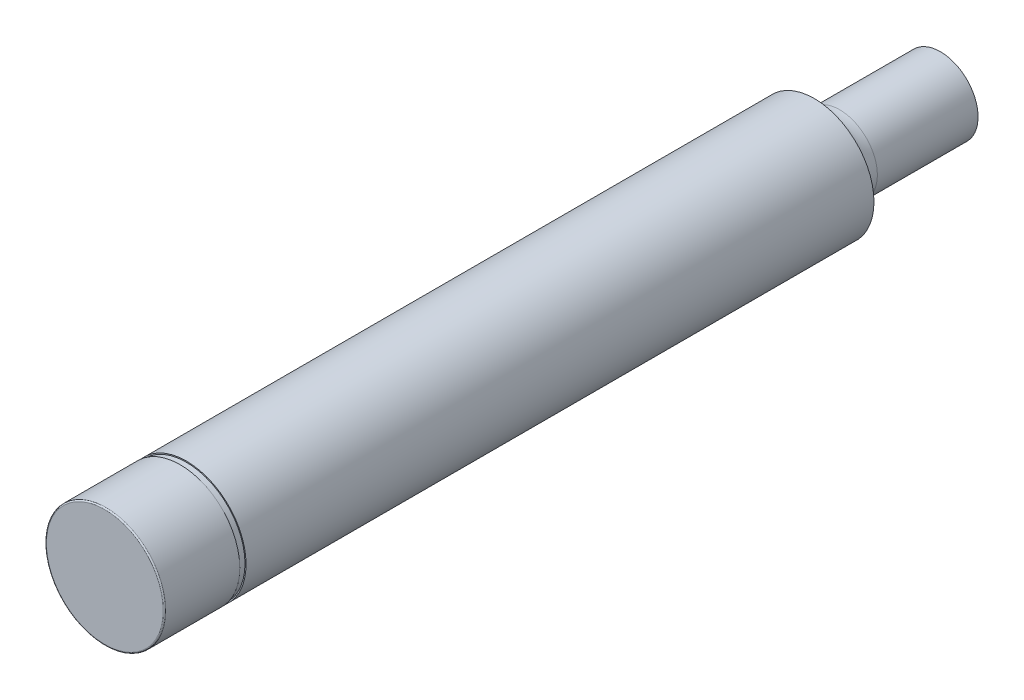
ISO-10303-21;
HEADER;
FILE_DESCRIPTION(('STEP AP214'),'2;1');
FILE_NAME('part.step','',(''),(''),'','','');
FILE_SCHEMA(('AUTOMOTIVE_DESIGN { 1 0 10303 214 1 1 1 1 }'));
ENDSEC;
DATA;
#1=APPLICATION_CONTEXT('core data for automotive mechanical design processes');
#2=APPLICATION_PROTOCOL_DEFINITION('international standard','automotive_design',2000,#1);
#3=PRODUCT_CONTEXT('',#1,'mechanical');
#4=PRODUCT('Part','Part','',(#3));
#5=PRODUCT_RELATED_PRODUCT_CATEGORY('part','',(#4));
#6=PRODUCT_DEFINITION_FORMATION('','',#4);
#7=PRODUCT_DEFINITION_CONTEXT('part definition',#1,'design');
#8=PRODUCT_DEFINITION('design','',#6,#7);
#9=PRODUCT_DEFINITION_SHAPE('','',#8);
#10=(LENGTH_UNIT() NAMED_UNIT(*) SI_UNIT(.MILLI.,.METRE.));
#11=(NAMED_UNIT(*) PLANE_ANGLE_UNIT() SI_UNIT($,.RADIAN.));
#12=(NAMED_UNIT(*) SI_UNIT($,.STERADIAN.) SOLID_ANGLE_UNIT());
#13=UNCERTAINTY_MEASURE_WITH_UNIT(LENGTH_MEASURE(1.E-05),#10,'distance_accuracy_value','');
#14=(GEOMETRIC_REPRESENTATION_CONTEXT(3) GLOBAL_UNCERTAINTY_ASSIGNED_CONTEXT((#13)) GLOBAL_UNIT_ASSIGNED_CONTEXT((#10,
#11,#12)) REPRESENTATION_CONTEXT('',''));
#15=CARTESIAN_POINT('',(0.,0.,0.));
#16=DIRECTION('',(0.,0.,1.));
#17=DIRECTION('',(1.,0.,0.));
#18=AXIS2_PLACEMENT_3D('',#15,#16,#17);
#19=CARTESIAN_POINT('',(0.,0.,0.));
#20=DIRECTION('',(0.,0.,1.));
#21=DIRECTION('',(1.,0.,0.));
#22=AXIS2_PLACEMENT_3D('',#19,#20,#21);
#23=PLANE('',#22);
#24=CARTESIAN_POINT('',(0.,0.,0.));
#25=DIRECTION('',(0.,0.,1.));
#26=DIRECTION('',(1.,0.,0.));
#27=AXIS2_PLACEMENT_3D('',#24,#25,#26);
#28=CIRCLE('',#27,2.);
#29=CARTESIAN_POINT('',(2.,0.,0.));
#30=VERTEX_POINT('',#29);
#31=EDGE_CURVE('E114',#30,#30,#28,.T.);
#32=ORIENTED_EDGE('',*,*,#31,.T.);
#33=EDGE_LOOP('',(#32));
#34=FACE_BOUND('',#33,.T.);
#35=CARTESIAN_POINT('',(0.038873115756179,0.,0.));
#36=DIRECTION('',(0.,0.,-1.));
#37=DIRECTION('',(-1.,0.,0.));
#38=AXIS2_PLACEMENT_3D('',#35,#36,#37);
#39=CIRCLE('',#38,3.);
#40=CARTESIAN_POINT('',(-2.96112688424382,0.,0.));
#41=VERTEX_POINT('',#40);
#42=EDGE_CURVE('E115',#41,#41,#39,.T.);
#43=ORIENTED_EDGE('',*,*,#42,.T.);
#44=EDGE_LOOP('',(#43));
#45=FACE_BOUND('',#44,.T.);
#46=ADVANCED_FACE('F40',(#34,#45),#23,.F.);
#47=CARTESIAN_POINT('',(0.,0.,60.));
#48=DIRECTION('',(0.,0.,-1.));
#49=DIRECTION('',(-1.,0.,0.));
#50=AXIS2_PLACEMENT_3D('',#47,#48,#49);
#51=CYLINDRICAL_SURFACE('',#50,4.75);
#52=CARTESIAN_POINT('',(0.,0.,60.));
#53=DIRECTION('',(0.,0.,1.));
#54=DIRECTION('',(1.,0.,0.));
#55=AXIS2_PLACEMENT_3D('',#52,#53,#54);
#56=CIRCLE('',#55,4.75);
#57=CARTESIAN_POINT('',(4.75,0.,60.));
#58=VERTEX_POINT('',#57);
#59=EDGE_CURVE('E117',#58,#58,#56,.T.);
#60=ORIENTED_EDGE('',*,*,#59,.F.);
#61=EDGE_LOOP('',(#60));
#62=FACE_BOUND('',#61,.T.);
#63=CARTESIAN_POINT('',(-4.75,0.,10.));
#64=CARTESIAN_POINT('',(-4.75001626152837,0.626174740003221,10.));
#65=CARTESIAN_POINT('',(-4.49907437973222,1.87880300784494,10.));
#66=CARTESIAN_POINT('',(-3.42711531146558,3.46754349275447,10.));
#67=CARTESIAN_POINT('',(-1.83012336098341,4.51779933947683,10.));
#68=CARTESIAN_POINT('',(0.0399095150425289,4.8732862767297,10.));
#69=CARTESIAN_POINT('',(1.89712141983918,4.48815441777118,10.));
#70=CARTESIAN_POINT('',(3.46278915198452,3.4273935554428,10.));
#71=CARTESIAN_POINT('',(4.50530923879185,1.85326143166033,10.));
#72=CARTESIAN_POINT('',(4.872463337825,0.00324386234706493,10.));
#73=CARTESIAN_POINT('',(4.50483561329711,-1.85611725521611,10.));
#74=CARTESIAN_POINT('',(3.46302080284727,-3.4264988058695,10.));
#75=CARTESIAN_POINT('',(1.89662552694967,-4.48892094096583,10.));
#76=CARTESIAN_POINT('',(0.0354728978590639,-4.87372853472948,9.99999999999997));
#77=CARTESIAN_POINT('',(-1.83585952835088,-4.51544438295885,10.));
#78=CARTESIAN_POINT('',(-3.42964271691283,-3.46437605227857,10.));
#79=CARTESIAN_POINT('',(-4.49897681056203,-1.87824543217439,10.));
#80=CARTESIAN_POINT('',(-4.74998373847164,-0.626174740003219,10.));
#81=CARTESIAN_POINT('',(-4.75,0.,10.));
#82=B_SPLINE_CURVE_WITH_KNOTS('',3,(#63,#64,#65,#66,#67,#68,#69,#70,#71,#72,#73,#74,#75,#76,#77,
#78,#79,#80,#81),.UNSPECIFIED.,.T.,.F.,(4,1,1,1,1,1,1,1,1,1,1,1,1,1,1,1,4),(-0.0307384777592751,
-0.028784661948106,-0.0268308461369369,-0.0248770303257678,-0.0229232145145987,
-0.0209693987034295,-0.0190155828922604,-0.0170617670810913,-0.0151079512699222,
-0.0131541354587531,-0.0112003196475839,-0.00924650383641482,-0.0072926880252457,
-0.00533887221407657,-0.00338505640290745,-0.00143124059173833,0.00052257521943079),.UNSPECIFIED.);
#83=CARTESIAN_POINT('',(-4.75,0.,10.));
#84=VERTEX_POINT('',#83);
#85=EDGE_CURVE('E111',#84,#84,#82,.T.);
#86=ORIENTED_EDGE('',*,*,#85,.F.);
#87=EDGE_LOOP('',(#86));
#88=FACE_BOUND('',#87,.T.);
#89=ADVANCED_FACE('F64',(#62,#88),#51,.T.);
#90=CARTESIAN_POINT('',(0.,0.,60.));
#91=DIRECTION('',(0.,0.,1.));
#92=DIRECTION('',(1.,0.,0.));
#93=AXIS2_PLACEMENT_3D('',#90,#91,#92);
#94=PLANE('',#93);
#95=CARTESIAN_POINT('',(0.,0.,60.));
#96=DIRECTION('',(0.,0.,1.));
#97=DIRECTION('',(1.,0.,0.));
#98=AXIS2_PLACEMENT_3D('',#95,#96,#97);
#99=CIRCLE('',#98,4.66340729655614);
#100=CARTESIAN_POINT('',(4.66340729655614,0.,60.));
#101=VERTEX_POINT('',#100);
#102=EDGE_CURVE('E51',#101,#101,#99,.T.);
#103=ORIENTED_EDGE('',*,*,#102,.F.);
#104=EDGE_LOOP('',(#103));
#105=FACE_BOUND('',#104,.T.);
#106=ORIENTED_EDGE('',*,*,#59,.T.);
#107=EDGE_LOOP('',(#106));
#108=FACE_BOUND('',#107,.T.);
#109=ADVANCED_FACE('F74',(#105,#108),#94,.T.);
#110=CARTESIAN_POINT('',(0.,0.,60.));
#111=DIRECTION('',(0.,0.,-1.));
#112=DIRECTION('',(-1.,0.,0.));
#113=AXIS2_PLACEMENT_3D('',#110,#111,#112);
#114=CYLINDRICAL_SURFACE('',#113,2.);
#115=CARTESIAN_POINT('',(0.,0.,56.5358983848623));
#116=DIRECTION('',(0.,0.,1.));
#117=DIRECTION('',(1.,0.,0.));
#118=AXIS2_PLACEMENT_3D('',#115,#116,#117);
#119=CIRCLE('',#118,2.);
#120=CARTESIAN_POINT('',(2.,0.,56.5358983848623));
#121=VERTEX_POINT('',#120);
#122=EDGE_CURVE('E130',#121,#121,#119,.T.);
#123=ORIENTED_EDGE('',*,*,#122,.T.);
#124=EDGE_LOOP('',(#123));
#125=FACE_BOUND('',#124,.T.);
#126=ORIENTED_EDGE('',*,*,#31,.F.);
#127=EDGE_LOOP('',(#126));
#128=FACE_BOUND('',#127,.T.);
#129=ADVANCED_FACE('F80',(#125,#128),#114,.F.);
#130=CARTESIAN_POINT('',(0.,0.,56.5358983848623));
#131=DIRECTION('',(0.,0.,1.));
#132=DIRECTION('',(1.,0.,0.));
#133=AXIS2_PLACEMENT_3D('',#130,#131,#132);
#134=CONICAL_SURFACE('',#133,2.,0.5235987755983);
#135=CARTESIAN_POINT('',(0.,0.,60.));
#136=DIRECTION('',(0.,0.,1.));
#137=DIRECTION('',(1.,0.,0.));
#138=AXIS2_PLACEMENT_3D('',#135,#136,#137);
#139=CIRCLE('',#138,3.99999999999999);
#140=CARTESIAN_POINT('',(3.99999999999999,0.,60.));
#141=VERTEX_POINT('',#140);
#142=EDGE_CURVE('E133',#141,#141,#139,.F.);
#143=ORIENTED_EDGE('',*,*,#142,.F.);
#144=EDGE_LOOP('',(#143));
#145=FACE_BOUND('',#144,.T.);
#146=ORIENTED_EDGE('',*,*,#122,.F.);
#147=EDGE_LOOP('',(#146));
#148=FACE_BOUND('',#147,.T.);
#149=ADVANCED_FACE('F77',(#145,#148),#134,.F.);
#150=CARTESIAN_POINT('',(0.038873115756179,0.,10.));
#151=DIRECTION('',(0.,0.,-1.));
#152=DIRECTION('',(-1.,0.,0.));
#153=AXIS2_PLACEMENT_3D('',#150,#151,#152);
#154=CYLINDRICAL_SURFACE('',#153,3.);
#155=CARTESIAN_POINT('',(-2.96112688424382,0.,8.01117485968487));
#156=CARTESIAN_POINT('',(-2.9611167007564,-0.39241073710059,8.01117487493159));
#157=CARTESIAN_POINT('',(-2.80513779411453,-1.1770582123849,8.0113895985819));
#158=CARTESIAN_POINT('',(-2.13897284038856,-2.17506144525743,8.01233287503525));
#159=CARTESIAN_POINT('',(-1.14150703205925,-2.84276039904291,8.01381749470189));
#160=CARTESIAN_POINT('',(0.0366896787045898,-3.07823477431649,8.01568206089719));
#161=CARTESIAN_POINT('',(1.21604127029261,-2.84429653978128,8.01766811308753));
#162=CARTESIAN_POINT('',(2.21448172219551,-2.17697907506071,8.01944247489447));
#163=CARTESIAN_POINT('',(2.88152292111241,-1.18137637259871,8.02067509204745));
#164=CARTESIAN_POINT('',(3.11747204943919,0.00206427816775088,8.02112012341305));
#165=CARTESIAN_POINT('',(2.88182642325387,1.17956029283598,8.02067565690416));
#166=CARTESIAN_POINT('',(2.21433308655281,2.17754753299249,8.01944219530179));
#167=CARTESIAN_POINT('',(1.21635971481586,2.84381140806213,8.01766871608865));
#168=CARTESIAN_POINT('',(0.0394966668773256,3.07797927521568,8.01568671911628));
#169=CARTESIAN_POINT('',(-1.1379077792681,2.84427120664698,8.0138229978946));
#170=CARTESIAN_POINT('',(-2.13739797543183,2.17705728145469,8.01233511060332));
#171=CARTESIAN_POINT('',(-2.80519889503904,1.17740621021864,8.01138950710157));
#172=CARTESIAN_POINT('',(-2.96113706773124,0.392410737100591,8.01117484443815));
#173=CARTESIAN_POINT('',(-2.96112688424382,0.,8.01117485968487));
#174=B_SPLINE_CURVE_WITH_KNOTS('',3,(#155,#156,#157,#158,#159,#160,#161,#162,#163,#164,#165,
#166,#167,#168,#169,#170,#171,#172,#173),.UNSPECIFIED.,.T.,.F.,(4,1,1,1,1,1,1,1,1,1,1,1,1,1,1,1,
4),(-0.0307384777592751,-0.028784661948106,-0.0268308461369369,-0.0248770303257678,
-0.0229232145145987,-0.0209693987034295,-0.0190155828922604,-0.0170617670810913,
-0.0151079512699222,-0.0131541354587531,-0.0112003196475839,-0.00924650383641481,
-0.00729268802524569,-0.00533887221407657,-0.00338505640290745,-0.00143124059173833,
0.00052257521943079),.UNSPECIFIED.);
#175=CARTESIAN_POINT('',(-2.96112688424382,0.,8.01117485968487));
#176=VERTEX_POINT('',#175);
#177=EDGE_CURVE('E55',#176,#176,#174,.F.);
#178=ORIENTED_EDGE('',*,*,#177,.T.);
#179=EDGE_LOOP('',(#178));
#180=FACE_BOUND('',#179,.T.);
#181=ORIENTED_EDGE('',*,*,#42,.F.);
#182=EDGE_LOOP('',(#181));
#183=FACE_BOUND('',#182,.T.);
#184=ADVANCED_FACE('F79',(#180,#183),#154,.T.);
#185=CARTESIAN_POINT('',(-4.75,0.,10.));
#186=CARTESIAN_POINT('',(-4.74998373847164,-0.626174740003219,10.));
#187=CARTESIAN_POINT('',(-4.49897681056203,-1.87824543217439,10.));
#188=CARTESIAN_POINT('',(-3.42964271691283,-3.46437605227857,10.));
#189=CARTESIAN_POINT('',(-1.83585952835088,-4.51544438295885,10.));
#190=CARTESIAN_POINT('',(0.0354728978590639,-4.87372853472948,9.99999999999997));
#191=CARTESIAN_POINT('',(1.89662552694967,-4.48892094096583,10.));
#192=CARTESIAN_POINT('',(3.46302080284727,-3.4264988058695,10.));
#193=CARTESIAN_POINT('',(4.50483561329711,-1.85611725521611,10.));
#194=CARTESIAN_POINT('',(4.872463337825,0.00324386234706493,10.));
#195=CARTESIAN_POINT('',(4.50530923879185,1.85326143166033,10.));
#196=CARTESIAN_POINT('',(3.46278915198452,3.4273935554428,10.));
#197=CARTESIAN_POINT('',(1.89712141983918,4.48815441777118,10.));
#198=CARTESIAN_POINT('',(0.0399095150425289,4.8732862767297,10.));
#199=CARTESIAN_POINT('',(-1.83012336098341,4.51779933947683,10.));
#200=CARTESIAN_POINT('',(-3.42711531146558,3.46754349275447,10.));
#201=CARTESIAN_POINT('',(-4.49907437973222,1.87880300784494,10.));
#202=CARTESIAN_POINT('',(-4.75001626152837,0.626174740003221,10.));
#203=CARTESIAN_POINT('',(-4.75,0.,10.));
#204=CARTESIAN_POINT('',(-4.44419443789605,0.,9.96753672597823));
#205=CARTESIAN_POINT('',(-4.44417921650944,-0.586179397555377,9.96753670777059));
#206=CARTESIAN_POINT('',(-4.20939551553512,-1.75827731365213,9.96725172871922));
#207=CARTESIAN_POINT('',(-3.20894099051278,-3.24367309943672,9.96604308530858));
#208=CARTESIAN_POINT('',(-1.71716615176227,-4.22891402071835,9.96425655990618));
#209=CARTESIAN_POINT('',(0.0354141985363997,-4.56592297481237,9.96218173808099));
#210=CARTESIAN_POINT('',(1.7795837841437,-4.20678006587591,9.96014275922609));
#211=CARTESIAN_POINT('',(3.24841276997896,-3.21202257043358,9.95844575029787));
#212=CARTESIAN_POINT('',(4.22579495445339,-1.74026088104148,9.95732672763041));
#213=CARTESIAN_POINT('',(4.57077491432439,0.00304132876336575,9.95693370332844));
#214=CARTESIAN_POINT('',(4.2262393270694,1.73758355748524,9.95732621973223));
#215=CARTESIAN_POINT('',(3.24819539877803,3.21286131196486,9.95844599808774));
#216=CARTESIAN_POINT('',(1.78004914586522,4.20606181265877,9.96014222963241));
#217=CARTESIAN_POINT('',(0.0395712948335787,4.56551219826176,9.96217686343642));
#218=CARTESIAN_POINT('',(-1.71179578620148,4.2311236636193,9.96425016019448));
#219=CARTESIAN_POINT('',(-3.20657633596022,3.24663978600776,9.96604022982195));
#220=CARTESIAN_POINT('',(-4.20948684385479,1.75879907168014,9.96725183796504));
#221=CARTESIAN_POINT('',(-4.44420965928267,0.586179397555378,9.96753674418587));
#222=CARTESIAN_POINT('',(-4.44419443789605,0.,9.96753672597823));
#223=CARTESIAN_POINT('',(-4.13838887579211,0.,9.93507345195646));
#224=CARTESIAN_POINT('',(-4.13837469454725,-0.546184055107535,9.93507341554119));
#225=CARTESIAN_POINT('',(-3.91981422050821,-1.63830919512987,9.93450345743843));
#226=CARTESIAN_POINT('',(-2.98823926411274,-3.02297014659487,9.93208617061716));
#227=CARTESIAN_POINT('',(-1.59847277517367,-3.94238365847785,9.92851311981237));
#228=CARTESIAN_POINT('',(0.0353554992137356,-4.25811741489526,9.92436347616201));
#229=CARTESIAN_POINT('',(1.66254204133773,-3.924639190786,9.92028551845217));
#230=CARTESIAN_POINT('',(3.03380473711064,-2.99754633499766,9.91689150059574));
#231=CARTESIAN_POINT('',(3.94675429560969,-1.62440450686685,9.91465345526081));
#232=CARTESIAN_POINT('',(4.26908649082379,0.00283879517966656,9.91386740665688));
#233=CARTESIAN_POINT('',(3.94716941534696,1.62190568331015,9.91465243946446));
#234=CARTESIAN_POINT('',(3.03360164557154,2.99832906848692,9.91689199617547));
#235=CARTESIAN_POINT('',(1.66297687189125,3.92396920754635,9.92028445926483));
#236=CARTESIAN_POINT('',(0.039233074624629,4.25773811979383,9.92435372687284));
#237=CARTESIAN_POINT('',(-1.59346821141955,3.94444798776177,9.92850032038896));
#238=CARTESIAN_POINT('',(-2.98603736045487,3.02573607926105,9.93208045964389));
#239=CARTESIAN_POINT('',(-3.91989930797737,1.63879513551534,9.93450367593008));
#240=CARTESIAN_POINT('',(-4.13840305703697,0.546184055107536,9.93507348837174));
#241=CARTESIAN_POINT('',(-4.13838887579211,0.,9.93507345195646));
#242=CARTESIAN_POINT('',(-3.47414104562806,0.,9.74328807973543));
#243=CARTESIAN_POINT('',(-3.47412912356626,-0.459322865214973,9.74328801703306));
#244=CARTESIAN_POINT('',(-3.29089226499379,-1.37776456799209,9.74230438829811));
#245=CARTESIAN_POINT('',(-2.50917602110838,-2.5439234146079,9.73813569215621));
#246=CARTESIAN_POINT('',(-1.34103230844384,-3.32097523686039,9.7319822099384));
#247=CARTESIAN_POINT('',(0.0352620524341726,-3.59121435484807,9.72484865178556));
#248=CARTESIAN_POINT('',(1.40923649763483,-3.31392078457066,9.71785238301314));
#249=CARTESIAN_POINT('',(2.56967943545147,-2.53365802104055,9.71204052955154));
#250=CARTESIAN_POINT('',(3.34358381542262,-1.37394937898276,9.70821379240854));
#251=CARTESIAN_POINT('',(3.6170761056637,0.00240094111460118,9.70687085411932));
#252=CARTESIAN_POINT('',(3.34393582322602,1.37183652882625,9.7082120560319));
#253=CARTESIAN_POINT('',(2.56950713856198,2.53431961584283,9.71204137631365));
#254=CARTESIAN_POINT('',(1.40960550516451,3.31335531425659,9.717850573758));
#255=CARTESIAN_POINT('',(0.0385343264195018,3.59090479445951,9.72483191742958));
#256=CARTESIAN_POINT('',(-1.33682185669345,3.32272628575136,9.73196018395262));
#257=CARTESIAN_POINT('',(-2.50732818077118,2.54625409217965,9.73812584404507));
#258=CARTESIAN_POINT('',(-3.29096379736457,1.37817262329775,9.74230476451238));
#259=CARTESIAN_POINT('',(-3.47415296768986,0.459322865214974,9.74328814243781));
#260=CARTESIAN_POINT('',(-3.47414104562806,0.,9.74328807973543));
#261=CARTESIAN_POINT('',(-3.08172038177863,0.,9.30700443559727));
#262=CARTESIAN_POINT('',(-3.0817097931697,-0.408042807570382,9.3070043784062));
#263=CARTESIAN_POINT('',(-2.91935165416538,-1.22394739968841,9.30610148477601));
#264=CARTESIAN_POINT('',(-2.22617498735509,-2.26118854627904,9.30228273305575));
#265=CARTESIAN_POINT('',(-1.18887608125284,-2.9543596553791,9.29666729695603));
#266=CARTESIAN_POINT('',(0.0354984962282055,-3.19791837670565,9.29019089029226));
#267=CARTESIAN_POINT('',(1.26021650948022,-2.95388693205883,9.28387571882834));
#268=CARTESIAN_POINT('',(2.29646245932234,-2.26025541478021,9.27865858520388));
#269=CARTESIAN_POINT('',(2.98848217858145,-1.226360924408,9.27523834589055));
#270=CARTESIAN_POINT('',(3.23321687082456,0.00214291797232203,9.27404096536654));
#271=CARTESIAN_POINT('',(2.98879702187603,1.22447553786474,9.27523679525993));
#272=CARTESIAN_POINT('',(2.2963082928183,2.26084561499944,9.2786593404235));
#273=CARTESIAN_POINT('',(1.26054676930109,2.95338307427778,9.28387410647337));
#274=CARTESIAN_POINT('',(0.0384139179885898,3.19765028987835,9.29017576362918));
#275=CARTESIAN_POINT('',(-1.18513428847027,2.95592636597488,9.29664724092565));
#276=CARTESIAN_POINT('',(-2.22453632399601,2.26326247852965,9.30227371331824));
#277=CARTESIAN_POINT('',(-2.91941518581894,1.22430944573388,9.30610182792246));
#278=CARTESIAN_POINT('',(-3.08173097038756,0.408042807570383,9.30700449278835));
#279=CARTESIAN_POINT('',(-3.08172038177863,0.,9.30700443559727));
#280=CARTESIAN_POINT('',(-2.96112688424382,0.,8.62622251954197));
#281=CARTESIAN_POINT('',(-2.96111670336148,-0.392343878509383,8.62622249965571));
#282=CARTESIAN_POINT('',(-2.80519237054961,-1.17685767924258,8.62589476578762));
#283=CARTESIAN_POINT('',(-2.1392362240038,-2.17476558552172,8.62452722711878));
#284=CARTESIAN_POINT('',(-1.14200415002775,-2.84253703287765,8.62256826814862));
#285=CARTESIAN_POINT('',(0.0360648281983005,-3.07822965943076,8.62039003718016));
#286=CARTESIAN_POINT('',(1.21548214308925,-2.84453778628528,8.61835538557948));
#287=CARTESIAN_POINT('',(2.21415390381863,-2.17733858720497,8.61674556648272));
#288=CARTESIAN_POINT('',(2.88144935791602,-1.18163912539577,8.61572714458415));
#289=CARTESIAN_POINT('',(3.11750879989159,0.00206472575385238,8.61537772595933));
#290=CARTESIAN_POINT('',(2.88175298412624,1.1798226926747,8.61572668602804));
#291=CARTESIAN_POINT('',(2.21400520343823,2.17790713695939,8.61674578742627));
#292=CARTESIAN_POINT('',(1.21580073050685,2.84405264058893,8.61835491712725));
#293=CARTESIAN_POINT('',(0.0388718471236659,3.07797478501681,8.62038511095765));
#294=CARTESIAN_POINT('',(-1.13840556309343,2.84404834754433,8.62256137841839));
#295=CARTESIAN_POINT('',(-2.13766185137407,2.17676128234268,8.62452400114908));
#296=CARTESIAN_POINT('',(-2.80525345584368,1.17720559181373,8.62589488510521));
#297=CARTESIAN_POINT('',(-2.96113706512617,0.392343878509384,8.62622253942824));
#298=CARTESIAN_POINT('',(-2.96112688424382,0.,8.62622251954197));
#299=CARTESIAN_POINT('',(-2.96112688424382,0.,8.31869868961342));
#300=CARTESIAN_POINT('',(-2.96111670205893,-0.392377307813886,8.31869868729237));
#301=CARTESIAN_POINT('',(-2.80516508388158,-1.17695794584129,8.31864218908562));
#302=CARTESIAN_POINT('',(-2.13910453810084,-2.17491351996329,8.31843004057457));
#303=CARTESIAN_POINT('',(-1.14175559754697,-2.84264872931485,8.3181928657516));
#304=CARTESIAN_POINT('',(0.0363772531537149,-3.07823223669612,8.31803602674963));
#305=CARTESIAN_POINT('',(1.21576171443444,-2.84441718013386,8.31801172972387));
#306=CARTESIAN_POINT('',(2.21431782196814,-2.17715883840856,8.31809400415681));
#307=CARTESIAN_POINT('',(2.88148614229194,-1.18150774911998,8.31820112971494));
#308=CARTESIAN_POINT('',(3.11749042327738,0.00206450196157675,8.31824891898769));
#309=CARTESIAN_POINT('',(2.88178970646437,1.17969149287498,8.31820118286099));
#310=CARTESIAN_POINT('',(2.21416915395775,2.17772734225396,8.31809397483221));
#311=CARTESIAN_POINT('',(1.21608023040353,2.84393204141975,8.31801179700298));
#312=CARTESIAN_POINT('',(0.0391842567238932,3.07797704993899,8.31803589274592));
#313=CARTESIAN_POINT('',(-1.13815667767502,2.84415979048013,8.31819217245822));
#314=CARTESIAN_POINT('',(-2.13752991931735,2.17690928648507,8.31842954535622));
#315=CARTESIAN_POINT('',(-2.80522617699093,1.17730590104203,8.3186422030119));
#316=CARTESIAN_POINT('',(-2.96113706642871,0.392377307813887,8.31869869193447));
#317=CARTESIAN_POINT('',(-2.96112688424382,0.,8.31869868961342));
#318=CARTESIAN_POINT('',(-2.96112688424382,0.,8.01117485968487));
#319=CARTESIAN_POINT('',(-2.9611167007564,-0.39241073710059,8.01117487493159));
#320=CARTESIAN_POINT('',(-2.80513779411453,-1.1770582123849,8.0113895985819));
#321=CARTESIAN_POINT('',(-2.13897284038856,-2.17506144525743,8.01233287503525));
#322=CARTESIAN_POINT('',(-1.14150703205925,-2.84276039904291,8.01381749470189));
#323=CARTESIAN_POINT('',(0.0366896787045898,-3.07823477431649,8.01568206089719));
#324=CARTESIAN_POINT('',(1.21604127029261,-2.84429653978128,8.01766811308753));
#325=CARTESIAN_POINT('',(2.21448172219551,-2.17697907506071,8.01944247489447));
#326=CARTESIAN_POINT('',(2.88152292111241,-1.18137637259871,8.02067509204745));
#327=CARTESIAN_POINT('',(3.11747204943919,0.00206427816775088,8.02112012341305));
#328=CARTESIAN_POINT('',(2.88182642325387,1.17956029283598,8.02067565690416));
#329=CARTESIAN_POINT('',(2.21433308655281,2.17754753299249,8.01944219530179));
#330=CARTESIAN_POINT('',(1.21635971481586,2.84381140806213,8.01766871608865));
#331=CARTESIAN_POINT('',(0.0394966668773256,3.07797927521568,8.01568671911628));
#332=CARTESIAN_POINT('',(-1.1379077792681,2.84427120664698,8.0138229978946));
#333=CARTESIAN_POINT('',(-2.13739797543183,2.17705728145469,8.01233511060332));
#334=CARTESIAN_POINT('',(-2.80519889503904,1.17740621021864,8.01138950710157));
#335=CARTESIAN_POINT('',(-2.96113706773124,0.392410737100591,8.01117484443815));
#336=CARTESIAN_POINT('',(-2.96112688424382,0.,8.01117485968487));
#337=B_SPLINE_SURFACE_WITH_KNOTS('',5,3,((#185,#186,#187,#188,#189,#190,#191,#192,#193,#194,
#195,#196,#197,#198,#199,#200,#201,#202,#203),(#204,#205,#206,#207,#208,#209,#210,#211,#212,
#213,#214,#215,#216,#217,#218,#219,#220,#221,#222),(#223,#224,#225,#226,#227,#228,#229,#230,
#231,#232,#233,#234,#235,#236,#237,#238,#239,#240,#241),(#242,#243,#244,#245,#246,#247,#248,
#249,#250,#251,#252,#253,#254,#255,#256,#257,#258,#259,#260),(#261,#262,#263,#264,#265,#266,
#267,#268,#269,#270,#271,#272,#273,#274,#275,#276,#277,#278,#279),(#280,#281,#282,#283,#284,
#285,#286,#287,#288,#289,#290,#291,#292,#293,#294,#295,#296,#297,#298),(#299,#300,#301,#302,
#303,#304,#305,#306,#307,#308,#309,#310,#311,#312,#313,#314,#315,#316,#317),(#318,#319,#320,
#321,#322,#323,#324,#325,#326,#327,#328,#329,#330,#331,#332,#333,#334,#335,#336)),.UNSPECIFIED.,
.F.,.T.,.F.,(6,2,6),(4,1,1,1,1,1,1,1,1,1,1,1,1,1,1,1,4),(0.,0.5,1.),(-0.0307384777592751,
-0.028784661948106,-0.0268308461369369,-0.0248770303257678,-0.0229232145145987,
-0.0209693987034295,-0.0190155828922604,-0.0170617670810913,-0.0151079512699222,
-0.0131541354587531,-0.0112003196475839,-0.00924650383641481,-0.00729268802524569,
-0.00533887221407657,-0.00338505640290745,-0.00143124059173833,0.00052257521943079),.UNSPECIFIED.);
#338=ORIENTED_EDGE('',*,*,#85,.T.);
#339=EDGE_LOOP('',(#338));
#340=FACE_BOUND('',#339,.T.);
#341=ORIENTED_EDGE('',*,*,#177,.F.);
#342=EDGE_LOOP('',(#341));
#343=FACE_BOUND('',#342,.T.);
#344=ADVANCED_FACE('F83',(#340,#343),#337,.T.);
#345=CARTESIAN_POINT('',(0.,0.,60.5));
#346=DIRECTION('',(0.,0.,-1.));
#347=DIRECTION('',(-1.,0.,0.));
#348=AXIS2_PLACEMENT_3D('',#345,#346,#347);
#349=CYLINDRICAL_SURFACE('',#348,4.66340729655614);
#350=CARTESIAN_POINT('',(0.,0.,60.5));
#351=DIRECTION('',(0.,0.,1.));
#352=DIRECTION('',(1.,0.,0.));
#353=AXIS2_PLACEMENT_3D('',#350,#351,#352);
#354=CIRCLE('',#353,4.66340729655614);
#355=CARTESIAN_POINT('',(4.66340729655614,0.,60.5));
#356=VERTEX_POINT('',#355);
#357=EDGE_CURVE('E120',#356,#356,#354,.T.);
#358=ORIENTED_EDGE('',*,*,#357,.F.);
#359=EDGE_LOOP('',(#358));
#360=FACE_BOUND('',#359,.T.);
#361=ORIENTED_EDGE('',*,*,#102,.T.);
#362=EDGE_LOOP('',(#361));
#363=FACE_BOUND('',#362,.T.);
#364=ADVANCED_FACE('F90',(#360,#363),#349,.T.);
#365=CARTESIAN_POINT('',(0.,0.,60.));
#366=DIRECTION('',(0.,0.,1.));
#367=DIRECTION('',(1.,0.,0.));
#368=AXIS2_PLACEMENT_3D('',#365,#366,#367);
#369=PLANE('',#368);
#370=ORIENTED_EDGE('',*,*,#142,.T.);
#371=EDGE_LOOP('',(#370));
#372=FACE_BOUND('',#371,.T.);
#373=ADVANCED_FACE('F199',(#372),#369,.F.);
#374=CARTESIAN_POINT('',(0.,0.,66.5));
#375=DIRECTION('',(0.,0.,-1.));
#376=DIRECTION('',(-1.,0.,0.));
#377=AXIS2_PLACEMENT_3D('',#374,#375,#376);
#378=CYLINDRICAL_SURFACE('',#377,4.75);
#379=CARTESIAN_POINT('',(0.,0.,66.4));
#380=DIRECTION('',(0.,0.,1.));
#381=DIRECTION('',(1.,0.,0.));
#382=AXIS2_PLACEMENT_3D('',#379,#380,#381);
#383=CIRCLE('',#382,4.75);
#384=CARTESIAN_POINT('',(4.75,0.,66.4));
#385=VERTEX_POINT('',#384);
#386=EDGE_CURVE('E10',#385,#385,#383,.F.);
#387=ORIENTED_EDGE('',*,*,#386,.T.);
#388=EDGE_LOOP('',(#387));
#389=FACE_BOUND('',#388,.T.);
#390=CARTESIAN_POINT('',(0.,0.,60.5));
#391=DIRECTION('',(0.,0.,1.));
#392=DIRECTION('',(1.,0.,0.));
#393=AXIS2_PLACEMENT_3D('',#390,#391,#392);
#394=CIRCLE('',#393,4.75);
#395=CARTESIAN_POINT('',(4.75,0.,60.5));
#396=VERTEX_POINT('',#395);
#397=EDGE_CURVE('E125',#396,#396,#394,.T.);
#398=ORIENTED_EDGE('',*,*,#397,.T.);
#399=EDGE_LOOP('',(#398));
#400=FACE_BOUND('',#399,.T.);
#401=ADVANCED_FACE('F208',(#389,#400),#378,.T.);
#402=CARTESIAN_POINT('',(0.,0.,66.5));
#403=DIRECTION('',(0.,0.,1.));
#404=DIRECTION('',(1.,0.,0.));
#405=AXIS2_PLACEMENT_3D('',#402,#403,#404);
#406=PLANE('',#405);
#407=CARTESIAN_POINT('',(0.,0.,66.5));
#408=DIRECTION('',(0.,0.,1.));
#409=DIRECTION('',(1.,0.,0.));
#410=AXIS2_PLACEMENT_3D('',#407,#408,#409);
#411=CIRCLE('',#410,4.65);
#412=CARTESIAN_POINT('',(4.65,0.,66.5));
#413=VERTEX_POINT('',#412);
#414=EDGE_CURVE('E47',#413,#413,#411,.T.);
#415=ORIENTED_EDGE('',*,*,#414,.T.);
#416=EDGE_LOOP('',(#415));
#417=FACE_BOUND('',#416,.T.);
#418=ADVANCED_FACE('F220',(#417),#406,.T.);
#419=CARTESIAN_POINT('',(0.,0.,60.5));
#420=DIRECTION('',(0.,0.,1.));
#421=DIRECTION('',(1.,0.,0.));
#422=AXIS2_PLACEMENT_3D('',#419,#420,#421);
#423=PLANE('',#422);
#424=ORIENTED_EDGE('',*,*,#357,.T.);
#425=EDGE_LOOP('',(#424));
#426=FACE_BOUND('',#425,.T.);
#427=ORIENTED_EDGE('',*,*,#397,.F.);
#428=EDGE_LOOP('',(#427));
#429=FACE_BOUND('',#428,.T.);
#430=ADVANCED_FACE('F215',(#426,#429),#423,.F.);
#431=CARTESIAN_POINT('',(0.,0.,66.4));
#432=DIRECTION('',(0.,0.,1.));
#433=DIRECTION('',(1.,0.,0.));
#434=AXIS2_PLACEMENT_3D('',#431,#432,#433);
#435=TOROIDAL_SURFACE('',#434,4.65,0.1);
#436=ORIENTED_EDGE('',*,*,#386,.F.);
#437=EDGE_LOOP('',(#436));
#438=FACE_BOUND('',#437,.T.);
#439=ORIENTED_EDGE('',*,*,#414,.F.);
#440=EDGE_LOOP('',(#439));
#441=FACE_BOUND('',#440,.T.);
#442=ADVANCED_FACE('F42',(#438,#441),#435,.T.);
#443=CLOSED_SHELL('',(#46,#89,#109,#129,#149,#184,#344,#364,#373,#401,#418,#430,#442));
#444=MANIFOLD_SOLID_BREP('B2',#443);
#445=ADVANCED_BREP_SHAPE_REPRESENTATION('',(#18,#444),#14);
#446=SHAPE_DEFINITION_REPRESENTATION(#9,#445);
ENDSEC;
END-ISO-10303-21;
